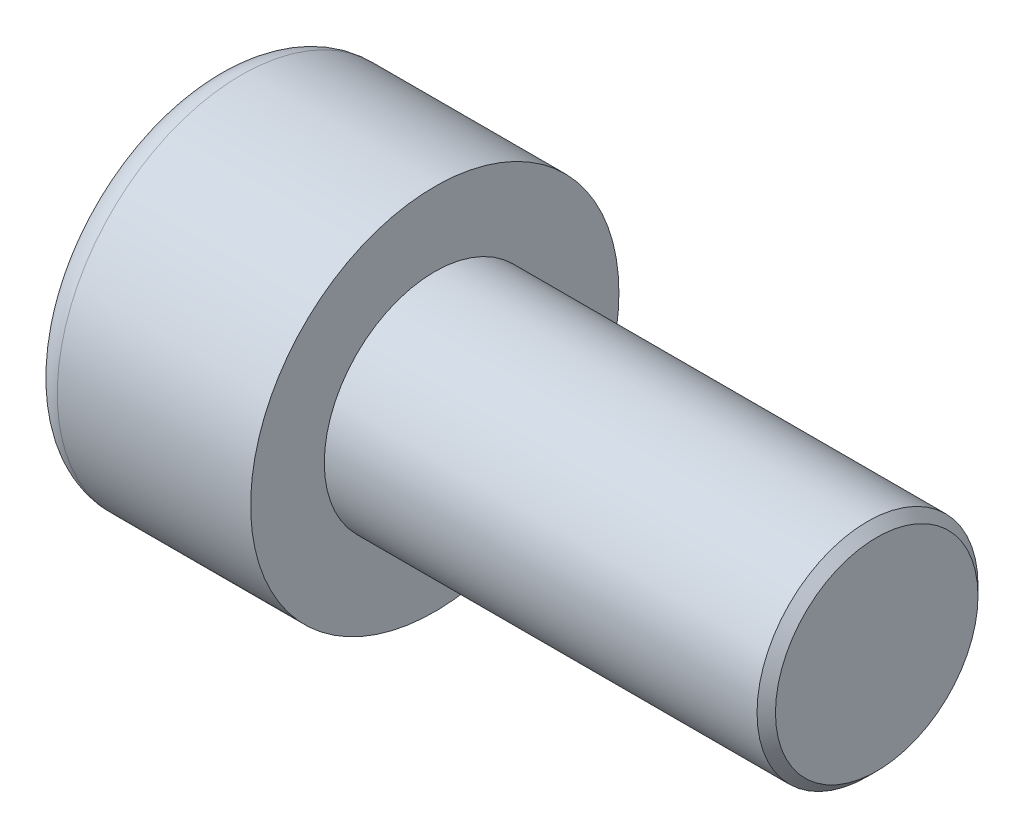
ISO-10303-21;
HEADER;
FILE_DESCRIPTION(('STEP AP214'),'2;1');
FILE_NAME('part.step','',(''),(''),'','','');
FILE_SCHEMA(('AUTOMOTIVE_DESIGN { 1 0 10303 214 1 1 1 1 }'));
ENDSEC;
DATA;
#1=APPLICATION_CONTEXT('core data for automotive mechanical design processes');
#2=APPLICATION_PROTOCOL_DEFINITION('international standard','automotive_design',2000,#1);
#3=PRODUCT_CONTEXT('',#1,'mechanical');
#4=PRODUCT('Part','Part','',(#3));
#5=PRODUCT_RELATED_PRODUCT_CATEGORY('part','',(#4));
#6=PRODUCT_DEFINITION_FORMATION('','',#4);
#7=PRODUCT_DEFINITION_CONTEXT('part definition',#1,'design');
#8=PRODUCT_DEFINITION('design','',#6,#7);
#9=PRODUCT_DEFINITION_SHAPE('','',#8);
#10=(LENGTH_UNIT() NAMED_UNIT(*) SI_UNIT(.MILLI.,.METRE.));
#11=(NAMED_UNIT(*) PLANE_ANGLE_UNIT() SI_UNIT($,.RADIAN.));
#12=(NAMED_UNIT(*) SI_UNIT($,.STERADIAN.) SOLID_ANGLE_UNIT());
#13=UNCERTAINTY_MEASURE_WITH_UNIT(LENGTH_MEASURE(1.E-05),#10,'distance_accuracy_value','');
#14=(GEOMETRIC_REPRESENTATION_CONTEXT(3) GLOBAL_UNCERTAINTY_ASSIGNED_CONTEXT((#13)) GLOBAL_UNIT_ASSIGNED_CONTEXT((#10,
#11,#12)) REPRESENTATION_CONTEXT('',''));
#15=CARTESIAN_POINT('',(0.,0.,0.));
#16=DIRECTION('',(0.,0.,1.));
#17=DIRECTION('',(1.,0.,0.));
#18=AXIS2_PLACEMENT_3D('',#15,#16,#17);
#19=CARTESIAN_POINT('',(3.,0.,-2.88675134594813));
#20=DIRECTION('',(1.,0.,0.));
#21=DIRECTION('',(0.,0.,-1.));
#22=AXIS2_PLACEMENT_3D('',#19,#20,#21);
#23=PLANE('',#22);
#24=CARTESIAN_POINT('',(3.,0.,0.));
#25=DIRECTION('',(1.,0.,0.));
#26=DIRECTION('',(0.,0.,-1.));
#27=AXIS2_PLACEMENT_3D('',#24,#25,#26);
#28=CIRCLE('',#27,2.5);
#29=CARTESIAN_POINT('',(3.,-1.25,-2.1650635094611));
#30=VERTEX_POINT('',#29);
#31=CARTESIAN_POINT('',(3.,-2.5,0.));
#32=VERTEX_POINT('',#31);
#33=EDGE_CURVE('E160',#30,#32,#28,.F.);
#34=ORIENTED_EDGE('',*,*,#33,.F.);
#35=DIRECTION('',(0.,0.866025403784438,-0.5));
#36=VECTOR('',#35,1.);
#37=CARTESIAN_POINT('',(3.,-2.5,-1.44337567297407));
#38=LINE('',#37,#36);
#39=CARTESIAN_POINT('',(3.,-2.5,-1.44337567297407));
#40=VERTEX_POINT('',#39);
#41=EDGE_CURVE('E168',#40,#30,#38,.T.);
#42=ORIENTED_EDGE('',*,*,#41,.F.);
#43=DIRECTION('',(0.,0.,-1.));
#44=VECTOR('',#43,1.);
#45=CARTESIAN_POINT('',(3.,-2.5,1.44337567297406));
#46=LINE('',#45,#44);
#47=EDGE_CURVE('E185',#32,#40,#46,.T.);
#48=ORIENTED_EDGE('',*,*,#47,.F.);
#49=EDGE_LOOP('',(#34,#42,#48));
#50=FACE_BOUND('',#49,.T.);
#51=ADVANCED_FACE('F37',(#50),#23,.F.);
#52=CARTESIAN_POINT('',(3.,-1.25,2.1650635094611));
#53=VERTEX_POINT('',#52);
#54=EDGE_CURVE('E290',#32,#53,#28,.F.);
#55=ORIENTED_EDGE('',*,*,#54,.F.);
#56=CARTESIAN_POINT('',(3.,-2.5,1.44337567297406));
#57=VERTEX_POINT('',#56);
#58=EDGE_CURVE('E186',#57,#32,#46,.T.);
#59=ORIENTED_EDGE('',*,*,#58,.F.);
#60=DIRECTION('',(0.,-0.866025403784439,-0.5));
#61=VECTOR('',#60,1.);
#62=CARTESIAN_POINT('',(3.,0.,2.88675134594813));
#63=LINE('',#62,#61);
#64=EDGE_CURVE('E181',#53,#57,#63,.T.);
#65=ORIENTED_EDGE('',*,*,#64,.F.);
#66=EDGE_LOOP('',(#55,#59,#65));
#67=FACE_BOUND('',#66,.T.);
#68=ADVANCED_FACE('F126',(#67),#23,.F.);
#69=CARTESIAN_POINT('',(3.,1.25,2.1650635094611));
#70=VERTEX_POINT('',#69);
#71=EDGE_CURVE('E286',#53,#70,#28,.F.);
#72=ORIENTED_EDGE('',*,*,#71,.F.);
#73=CARTESIAN_POINT('',(3.,0.,2.88675134594813));
#74=VERTEX_POINT('',#73);
#75=EDGE_CURVE('E182',#74,#53,#63,.T.);
#76=ORIENTED_EDGE('',*,*,#75,.F.);
#77=DIRECTION('',(0.,-0.866025403784439,0.5));
#78=VECTOR('',#77,1.);
#79=CARTESIAN_POINT('',(3.,2.5,1.44337567297406));
#80=LINE('',#79,#78);
#81=EDGE_CURVE('E177',#70,#74,#80,.T.);
#82=ORIENTED_EDGE('',*,*,#81,.F.);
#83=EDGE_LOOP('',(#72,#76,#82));
#84=FACE_BOUND('',#83,.T.);
#85=ADVANCED_FACE('F132',(#84),#23,.F.);
#86=CARTESIAN_POINT('',(3.,2.5,0.));
#87=VERTEX_POINT('',#86);
#88=EDGE_CURVE('E157',#70,#87,#28,.F.);
#89=ORIENTED_EDGE('',*,*,#88,.F.);
#90=CARTESIAN_POINT('',(3.,2.5,1.44337567297406));
#91=VERTEX_POINT('',#90);
#92=EDGE_CURVE('E178',#91,#70,#80,.T.);
#93=ORIENTED_EDGE('',*,*,#92,.F.);
#94=DIRECTION('',(0.,0.,1.));
#95=VECTOR('',#94,1.);
#96=CARTESIAN_POINT('',(3.,2.5,-1.44337567297406));
#97=LINE('',#96,#95);
#98=EDGE_CURVE('E172',#87,#91,#97,.T.);
#99=ORIENTED_EDGE('',*,*,#98,.F.);
#100=EDGE_LOOP('',(#89,#93,#99));
#101=FACE_BOUND('',#100,.T.);
#102=ADVANCED_FACE('F146',(#101),#23,.F.);
#103=CARTESIAN_POINT('',(3.,0.,0.));
#104=DIRECTION('',(1.,0.,0.));
#105=DIRECTION('',(0.,0.,-1.));
#106=AXIS2_PLACEMENT_3D('',#103,#104,#105);
#107=CIRCLE('',#106,2.5);
#108=CARTESIAN_POINT('',(3.,1.25,-2.1650635094611));
#109=VERTEX_POINT('',#108);
#110=EDGE_CURVE('E52',#109,#87,#107,.T.);
#111=ORIENTED_EDGE('',*,*,#110,.T.);
#112=CARTESIAN_POINT('',(3.,2.5,-1.44337567297406));
#113=VERTEX_POINT('',#112);
#114=EDGE_CURVE('E165',#113,#87,#97,.T.);
#115=ORIENTED_EDGE('',*,*,#114,.F.);
#116=DIRECTION('',(0.,0.866025403784438,0.5));
#117=VECTOR('',#116,1.);
#118=CARTESIAN_POINT('',(3.,0.,-2.88675134594813));
#119=LINE('',#118,#117);
#120=EDGE_CURVE('E162',#109,#113,#119,.T.);
#121=ORIENTED_EDGE('',*,*,#120,.F.);
#122=EDGE_LOOP('',(#111,#115,#121));
#123=FACE_BOUND('',#122,.T.);
#124=ADVANCED_FACE('F137',(#123),#23,.F.);
#125=EDGE_CURVE('E150',#109,#30,#28,.F.);
#126=ORIENTED_EDGE('',*,*,#125,.F.);
#127=CARTESIAN_POINT('',(3.,0.,-2.88675134594813));
#128=VERTEX_POINT('',#127);
#129=EDGE_CURVE('E153',#128,#109,#119,.T.);
#130=ORIENTED_EDGE('',*,*,#129,.F.);
#131=EDGE_CURVE('E155',#30,#128,#38,.T.);
#132=ORIENTED_EDGE('',*,*,#131,.F.);
#133=EDGE_LOOP('',(#126,#130,#132));
#134=FACE_BOUND('',#133,.T.);
#135=ADVANCED_FACE('F128',(#134),#23,.F.);
#136=CARTESIAN_POINT('',(0.,0.,0.));
#137=DIRECTION('',(1.,0.,0.));
#138=DIRECTION('',(0.,0.,-1.));
#139=AXIS2_PLACEMENT_3D('',#136,#137,#138);
#140=PLANE('',#139);
#141=CARTESIAN_POINT('',(0.,0.,0.));
#142=DIRECTION('',(1.,0.,0.));
#143=DIRECTION('',(0.,0.,-1.));
#144=AXIS2_PLACEMENT_3D('',#141,#142,#143);
#145=CIRCLE('',#144,4.25);
#146=CARTESIAN_POINT('',(0.,0.,-4.25));
#147=VERTEX_POINT('',#146);
#148=EDGE_CURVE('E225',#147,#147,#145,.F.);
#149=ORIENTED_EDGE('',*,*,#148,.T.);
#150=EDGE_LOOP('',(#149));
#151=FACE_BOUND('',#150,.T.);
#152=DIRECTION('',(0.,0.866025403784438,-0.5));
#153=VECTOR('',#152,1.);
#154=CARTESIAN_POINT('',(0.,-2.5,-1.44337567297407));
#155=LINE('',#154,#153);
#156=CARTESIAN_POINT('',(0.,-2.5,-1.44337567297407));
#157=VERTEX_POINT('',#156);
#158=CARTESIAN_POINT('',(0.,0.,-2.88675134594813));
#159=VERTEX_POINT('',#158);
#160=EDGE_CURVE('E60',#157,#159,#155,.T.);
#161=ORIENTED_EDGE('',*,*,#160,.T.);
#162=DIRECTION('',(0.,0.866025403784438,0.5));
#163=VECTOR('',#162,1.);
#164=CARTESIAN_POINT('',(0.,0.,-2.88675134594813));
#165=LINE('',#164,#163);
#166=CARTESIAN_POINT('',(0.,2.5,-1.44337567297406));
#167=VERTEX_POINT('',#166);
#168=EDGE_CURVE('E191',#159,#167,#165,.T.);
#169=ORIENTED_EDGE('',*,*,#168,.T.);
#170=DIRECTION('',(0.,0.,1.));
#171=VECTOR('',#170,1.);
#172=CARTESIAN_POINT('',(0.,2.5,-1.44337567297406));
#173=LINE('',#172,#171);
#174=CARTESIAN_POINT('',(0.,2.5,1.44337567297406));
#175=VERTEX_POINT('',#174);
#176=EDGE_CURVE('E194',#167,#175,#173,.T.);
#177=ORIENTED_EDGE('',*,*,#176,.T.);
#178=DIRECTION('',(0.,-0.866025403784439,0.5));
#179=VECTOR('',#178,1.);
#180=CARTESIAN_POINT('',(0.,2.5,1.44337567297406));
#181=LINE('',#180,#179);
#182=CARTESIAN_POINT('',(0.,0.,2.88675134594813));
#183=VERTEX_POINT('',#182);
#184=EDGE_CURVE('E197',#175,#183,#181,.T.);
#185=ORIENTED_EDGE('',*,*,#184,.T.);
#186=DIRECTION('',(0.,-0.866025403784439,-0.5));
#187=VECTOR('',#186,1.);
#188=CARTESIAN_POINT('',(0.,0.,2.88675134594813));
#189=LINE('',#188,#187);
#190=CARTESIAN_POINT('',(0.,-2.5,1.44337567297406));
#191=VERTEX_POINT('',#190);
#192=EDGE_CURVE('E200',#183,#191,#189,.T.);
#193=ORIENTED_EDGE('',*,*,#192,.T.);
#194=DIRECTION('',(0.,0.,-1.));
#195=VECTOR('',#194,1.);
#196=CARTESIAN_POINT('',(0.,-2.5,1.44337567297406));
#197=LINE('',#196,#195);
#198=EDGE_CURVE('E203',#191,#157,#197,.T.);
#199=ORIENTED_EDGE('',*,*,#198,.T.);
#200=EDGE_LOOP('',(#161,#169,#177,#185,#193,#199));
#201=FACE_BOUND('',#200,.T.);
#202=ADVANCED_FACE('F136',(#151,#201),#140,.F.);
#203=CARTESIAN_POINT('',(6.,0.,0.));
#204=DIRECTION('',(1.,0.,0.));
#205=DIRECTION('',(0.,0.,-1.));
#206=AXIS2_PLACEMENT_3D('',#203,#204,#205);
#207=PLANE('',#206);
#208=CARTESIAN_POINT('',(6.,0.,0.));
#209=DIRECTION('',(1.,0.,0.));
#210=DIRECTION('',(0.,0.,-1.));
#211=AXIS2_PLACEMENT_3D('',#208,#209,#210);
#212=CIRCLE('',#211,5.);
#213=CARTESIAN_POINT('',(6.,0.,-5.));
#214=VERTEX_POINT('',#213);
#215=EDGE_CURVE('E158',#214,#214,#212,.T.);
#216=ORIENTED_EDGE('',*,*,#215,.T.);
#217=EDGE_LOOP('',(#216));
#218=FACE_BOUND('',#217,.T.);
#219=CARTESIAN_POINT('',(6.,0.,0.));
#220=DIRECTION('',(1.,0.,0.));
#221=DIRECTION('',(0.,0.,-1.));
#222=AXIS2_PLACEMENT_3D('',#219,#220,#221);
#223=CIRCLE('',#222,3.);
#224=CARTESIAN_POINT('',(6.,0.,-3.));
#225=VERTEX_POINT('',#224);
#226=EDGE_CURVE('E216',#225,#225,#223,.T.);
#227=ORIENTED_EDGE('',*,*,#226,.F.);
#228=EDGE_LOOP('',(#227));
#229=FACE_BOUND('',#228,.T.);
#230=ADVANCED_FACE('F143',(#218,#229),#207,.T.);
#231=CARTESIAN_POINT('',(6.,0.,0.));
#232=DIRECTION('',(-1.,0.,0.));
#233=DIRECTION('',(0.,0.,1.));
#234=AXIS2_PLACEMENT_3D('',#231,#232,#233);
#235=CYLINDRICAL_SURFACE('',#234,5.);
#236=CARTESIAN_POINT('',(0.75,0.,0.));
#237=DIRECTION('',(1.,0.,0.));
#238=DIRECTION('',(0.,0.,-1.));
#239=AXIS2_PLACEMENT_3D('',#236,#237,#238);
#240=CIRCLE('',#239,5.);
#241=CARTESIAN_POINT('',(0.75,0.,-5.));
#242=VERTEX_POINT('',#241);
#243=EDGE_CURVE('E222',#242,#242,#240,.T.);
#244=ORIENTED_EDGE('',*,*,#243,.T.);
#245=EDGE_LOOP('',(#244));
#246=FACE_BOUND('',#245,.T.);
#247=ORIENTED_EDGE('',*,*,#215,.F.);
#248=EDGE_LOOP('',(#247));
#249=FACE_BOUND('',#248,.T.);
#250=ADVANCED_FACE('F241',(#246,#249),#235,.T.);
#251=CARTESIAN_POINT('',(18.,0.,0.));
#252=DIRECTION('',(-1.,0.,0.));
#253=DIRECTION('',(0.,0.,1.));
#254=AXIS2_PLACEMENT_3D('',#251,#252,#253);
#255=CYLINDRICAL_SURFACE('',#254,3.);
#256=CARTESIAN_POINT('',(17.75,0.,0.));
#257=DIRECTION('',(1.,0.,0.));
#258=DIRECTION('',(0.,0.,-1.));
#259=AXIS2_PLACEMENT_3D('',#256,#257,#258);
#260=CIRCLE('',#259,3.);
#261=CARTESIAN_POINT('',(17.75,0.,-3.));
#262=VERTEX_POINT('',#261);
#263=EDGE_CURVE('E11',#262,#262,#260,.F.);
#264=ORIENTED_EDGE('',*,*,#263,.T.);
#265=EDGE_LOOP('',(#264));
#266=FACE_BOUND('',#265,.T.);
#267=ORIENTED_EDGE('',*,*,#226,.T.);
#268=EDGE_LOOP('',(#267));
#269=FACE_BOUND('',#268,.T.);
#270=ADVANCED_FACE('F238',(#266,#269),#255,.T.);
#271=CARTESIAN_POINT('',(18.,0.,0.));
#272=DIRECTION('',(1.,0.,0.));
#273=DIRECTION('',(0.,0.,-1.));
#274=AXIS2_PLACEMENT_3D('',#271,#272,#273);
#275=PLANE('',#274);
#276=CARTESIAN_POINT('',(18.,0.,0.));
#277=DIRECTION('',(1.,0.,0.));
#278=DIRECTION('',(0.,0.,-1.));
#279=AXIS2_PLACEMENT_3D('',#276,#277,#278);
#280=CIRCLE('',#279,2.75);
#281=CARTESIAN_POINT('',(18.,0.,-2.75));
#282=VERTEX_POINT('',#281);
#283=EDGE_CURVE('E45',#282,#282,#280,.T.);
#284=ORIENTED_EDGE('',*,*,#283,.T.);
#285=EDGE_LOOP('',(#284));
#286=FACE_BOUND('',#285,.T.);
#287=ADVANCED_FACE('F230',(#286),#275,.T.);
#288=CARTESIAN_POINT('',(3.,-2.5,-1.44337567297407));
#289=DIRECTION('',(0.,0.5,0.866025403784439));
#290=DIRECTION('',(0.,-0.866025403784439,0.5));
#291=AXIS2_PLACEMENT_3D('',#288,#289,#290);
#292=PLANE('',#291);
#293=ORIENTED_EDGE('',*,*,#160,.F.);
#294=DIRECTION('',(-1.,0.,0.));
#295=VECTOR('',#294,1.);
#296=CARTESIAN_POINT('',(3.,-2.5,-1.44337567297407));
#297=LINE('',#296,#295);
#298=EDGE_CURVE('E189',#40,#157,#297,.T.);
#299=ORIENTED_EDGE('',*,*,#298,.F.);
#300=ORIENTED_EDGE('',*,*,#41,.T.);
#301=ORIENTED_EDGE('',*,*,#131,.T.);
#302=DIRECTION('',(-1.,0.,0.));
#303=VECTOR('',#302,1.);
#304=CARTESIAN_POINT('',(3.,0.,-2.88675134594813));
#305=LINE('',#304,#303);
#306=EDGE_CURVE('E171',#128,#159,#305,.T.);
#307=ORIENTED_EDGE('',*,*,#306,.T.);
#308=EDGE_LOOP('',(#293,#299,#300,#301,#307));
#309=FACE_BOUND('',#308,.T.);
#310=ADVANCED_FACE('F256',(#309),#292,.T.);
#311=CARTESIAN_POINT('',(3.,0.,-2.88675134594813));
#312=DIRECTION('',(0.,-0.5,0.866025403784438));
#313=DIRECTION('',(0.,-0.866025403784438,-0.5));
#314=AXIS2_PLACEMENT_3D('',#311,#312,#313);
#315=PLANE('',#314);
#316=ORIENTED_EDGE('',*,*,#168,.F.);
#317=ORIENTED_EDGE('',*,*,#306,.F.);
#318=ORIENTED_EDGE('',*,*,#129,.T.);
#319=ORIENTED_EDGE('',*,*,#120,.T.);
#320=DIRECTION('',(-1.,0.,0.));
#321=VECTOR('',#320,1.);
#322=CARTESIAN_POINT('',(3.,2.5,-1.44337567297406));
#323=LINE('',#322,#321);
#324=EDGE_CURVE('E213',#113,#167,#323,.T.);
#325=ORIENTED_EDGE('',*,*,#324,.T.);
#326=EDGE_LOOP('',(#316,#317,#318,#319,#325));
#327=FACE_BOUND('',#326,.T.);
#328=ADVANCED_FACE('F170',(#327),#315,.T.);
#329=CARTESIAN_POINT('',(3.,2.5,-1.44337567297406));
#330=DIRECTION('',(0.,-1.,0.));
#331=DIRECTION('',(0.,0.,-1.));
#332=AXIS2_PLACEMENT_3D('',#329,#330,#331);
#333=PLANE('',#332);
#334=ORIENTED_EDGE('',*,*,#176,.F.);
#335=ORIENTED_EDGE('',*,*,#324,.F.);
#336=ORIENTED_EDGE('',*,*,#114,.T.);
#337=ORIENTED_EDGE('',*,*,#98,.T.);
#338=DIRECTION('',(-1.,0.,0.));
#339=VECTOR('',#338,1.);
#340=CARTESIAN_POINT('',(3.,2.5,1.44337567297406));
#341=LINE('',#340,#339);
#342=EDGE_CURVE('E211',#91,#175,#341,.T.);
#343=ORIENTED_EDGE('',*,*,#342,.T.);
#344=EDGE_LOOP('',(#334,#335,#336,#337,#343));
#345=FACE_BOUND('',#344,.T.);
#346=ADVANCED_FACE('F261',(#345),#333,.T.);
#347=CARTESIAN_POINT('',(3.,2.5,1.44337567297406));
#348=DIRECTION('',(0.,-0.5,-0.866025403784438));
#349=DIRECTION('',(0.,0.866025403784439,-0.5));
#350=AXIS2_PLACEMENT_3D('',#347,#348,#349);
#351=PLANE('',#350);
#352=ORIENTED_EDGE('',*,*,#184,.F.);
#353=ORIENTED_EDGE('',*,*,#342,.F.);
#354=ORIENTED_EDGE('',*,*,#92,.T.);
#355=ORIENTED_EDGE('',*,*,#81,.T.);
#356=DIRECTION('',(-1.,0.,0.));
#357=VECTOR('',#356,1.);
#358=CARTESIAN_POINT('',(3.,0.,2.88675134594813));
#359=LINE('',#358,#357);
#360=EDGE_CURVE('E209',#74,#183,#359,.T.);
#361=ORIENTED_EDGE('',*,*,#360,.T.);
#362=EDGE_LOOP('',(#352,#353,#354,#355,#361));
#363=FACE_BOUND('',#362,.T.);
#364=ADVANCED_FACE('F264',(#363),#351,.T.);
#365=CARTESIAN_POINT('',(3.,0.,2.88675134594813));
#366=DIRECTION('',(0.,0.5,-0.866025403784438));
#367=DIRECTION('',(0.,0.866025403784439,0.5));
#368=AXIS2_PLACEMENT_3D('',#365,#366,#367);
#369=PLANE('',#368);
#370=ORIENTED_EDGE('',*,*,#192,.F.);
#371=ORIENTED_EDGE('',*,*,#360,.F.);
#372=ORIENTED_EDGE('',*,*,#75,.T.);
#373=ORIENTED_EDGE('',*,*,#64,.T.);
#374=DIRECTION('',(-1.,0.,0.));
#375=VECTOR('',#374,1.);
#376=CARTESIAN_POINT('',(3.,-2.5,1.44337567297406));
#377=LINE('',#376,#375);
#378=EDGE_CURVE('E207',#57,#191,#377,.T.);
#379=ORIENTED_EDGE('',*,*,#378,.T.);
#380=EDGE_LOOP('',(#370,#371,#372,#373,#379));
#381=FACE_BOUND('',#380,.T.);
#382=ADVANCED_FACE('F121',(#381),#369,.T.);
#383=CARTESIAN_POINT('',(3.,-2.5,1.44337567297406));
#384=DIRECTION('',(0.,1.,0.));
#385=DIRECTION('',(0.,0.,1.));
#386=AXIS2_PLACEMENT_3D('',#383,#384,#385);
#387=PLANE('',#386);
#388=ORIENTED_EDGE('',*,*,#198,.F.);
#389=ORIENTED_EDGE('',*,*,#378,.F.);
#390=ORIENTED_EDGE('',*,*,#58,.T.);
#391=ORIENTED_EDGE('',*,*,#47,.T.);
#392=ORIENTED_EDGE('',*,*,#298,.T.);
#393=EDGE_LOOP('',(#388,#389,#390,#391,#392));
#394=FACE_BOUND('',#393,.T.);
#395=ADVANCED_FACE('F114',(#394),#387,.T.);
#396=CARTESIAN_POINT('',(3.,0.,0.));
#397=DIRECTION('',(-1.,0.,0.));
#398=DIRECTION('',(0.,0.,1.));
#399=AXIS2_PLACEMENT_3D('',#396,#397,#398);
#400=CONICAL_SURFACE('',#399,2.5,1.04719755119659);
#401=CARTESIAN_POINT('',(4.44337567297408,0.,0.));
#402=VERTEX_POINT('',#401);
#403=VERTEX_LOOP('',#402);
#404=FACE_BOUND('',#403,.T.);
#405=ORIENTED_EDGE('',*,*,#110,.F.);
#406=ORIENTED_EDGE('',*,*,#125,.T.);
#407=ORIENTED_EDGE('',*,*,#33,.T.);
#408=ORIENTED_EDGE('',*,*,#54,.T.);
#409=ORIENTED_EDGE('',*,*,#71,.T.);
#410=ORIENTED_EDGE('',*,*,#88,.T.);
#411=EDGE_LOOP('',(#405,#406,#407,#408,#409,#410));
#412=FACE_BOUND('',#411,.T.);
#413=ADVANCED_FACE('F111',(#404,#412),#400,.F.);
#414=CARTESIAN_POINT('',(0.75,0.,0.));
#415=DIRECTION('',(1.,0.,0.));
#416=DIRECTION('',(0.,0.,-1.));
#417=AXIS2_PLACEMENT_3D('',#414,#415,#416);
#418=TOROIDAL_SURFACE('',#417,4.25,0.75);
#419=ORIENTED_EDGE('',*,*,#148,.F.);
#420=EDGE_LOOP('',(#419));
#421=FACE_BOUND('',#420,.T.);
#422=ORIENTED_EDGE('',*,*,#243,.F.);
#423=EDGE_LOOP('',(#422));
#424=FACE_BOUND('',#423,.T.);
#425=ADVANCED_FACE('F113',(#421,#424),#418,.T.);
#426=CARTESIAN_POINT('',(18.,0.,0.));
#427=DIRECTION('',(-1.,0.,0.));
#428=DIRECTION('',(0.,0.,1.));
#429=AXIS2_PLACEMENT_3D('',#426,#427,#428);
#430=CONICAL_SURFACE('',#429,2.75,0.785398163397451);
#431=ORIENTED_EDGE('',*,*,#263,.F.);
#432=EDGE_LOOP('',(#431));
#433=FACE_BOUND('',#432,.T.);
#434=ORIENTED_EDGE('',*,*,#283,.F.);
#435=EDGE_LOOP('',(#434));
#436=FACE_BOUND('',#435,.T.);
#437=ADVANCED_FACE('F39',(#433,#436),#430,.T.);
#438=CLOSED_SHELL('',(#51,#68,#85,#102,#124,#135,#202,#230,#250,#270,#287,#310,#328,#346,#364,
#382,#395,#413,#425,#437));
#439=MANIFOLD_SOLID_BREP('B2',#438);
#440=ADVANCED_BREP_SHAPE_REPRESENTATION('',(#18,#439),#14);
#441=SHAPE_DEFINITION_REPRESENTATION(#9,#440);
ENDSEC;
END-ISO-10303-21;
